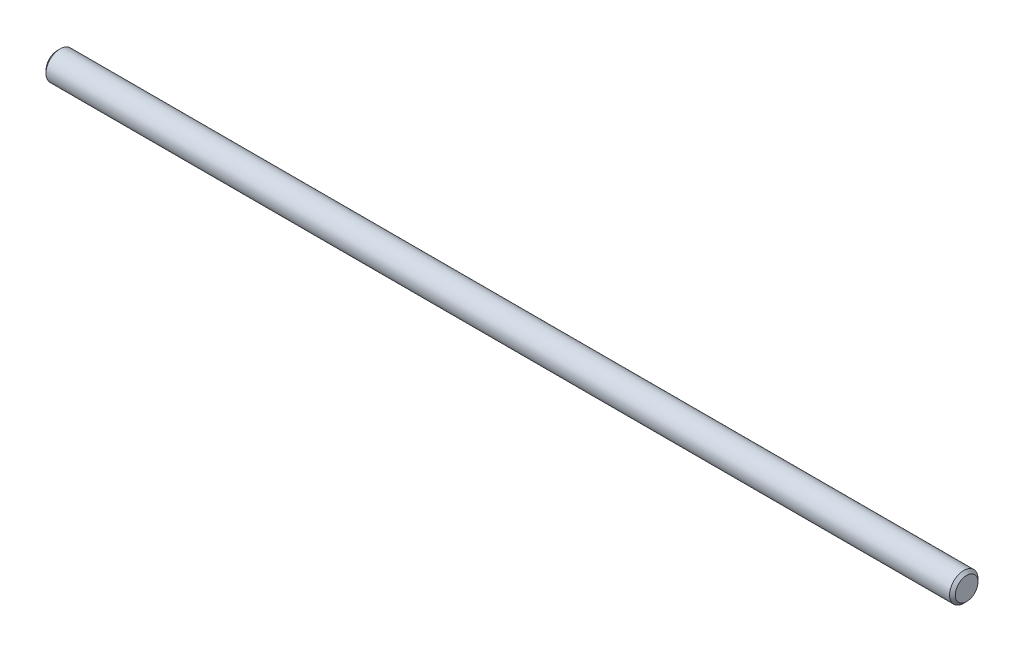
ISO-10303-21;
HEADER;
FILE_DESCRIPTION(('STEP AP214'),'2;1');
FILE_NAME('part.step','',(''),(''),'','','');
FILE_SCHEMA(('AUTOMOTIVE_DESIGN { 1 0 10303 214 1 1 1 1 }'));
ENDSEC;
DATA;
#1=APPLICATION_CONTEXT('core data for automotive mechanical design processes');
#2=APPLICATION_PROTOCOL_DEFINITION('international standard','automotive_design',2000,#1);
#3=PRODUCT_CONTEXT('',#1,'mechanical');
#4=PRODUCT('Part','Part','',(#3));
#5=PRODUCT_RELATED_PRODUCT_CATEGORY('part','',(#4));
#6=PRODUCT_DEFINITION_FORMATION('','',#4);
#7=PRODUCT_DEFINITION_CONTEXT('part definition',#1,'design');
#8=PRODUCT_DEFINITION('design','',#6,#7);
#9=PRODUCT_DEFINITION_SHAPE('','',#8);
#10=(LENGTH_UNIT() NAMED_UNIT(*) SI_UNIT(.MILLI.,.METRE.));
#11=(NAMED_UNIT(*) PLANE_ANGLE_UNIT() SI_UNIT($,.RADIAN.));
#12=(NAMED_UNIT(*) SI_UNIT($,.STERADIAN.) SOLID_ANGLE_UNIT());
#13=UNCERTAINTY_MEASURE_WITH_UNIT(LENGTH_MEASURE(1.E-05),#10,'distance_accuracy_value','');
#14=(GEOMETRIC_REPRESENTATION_CONTEXT(3) GLOBAL_UNCERTAINTY_ASSIGNED_CONTEXT((#13)) GLOBAL_UNIT_ASSIGNED_CONTEXT((#10,
#11,#12)) REPRESENTATION_CONTEXT('',''));
#15=CARTESIAN_POINT('',(0.,0.,0.));
#16=DIRECTION('',(0.,0.,1.));
#17=DIRECTION('',(1.,0.,0.));
#18=AXIS2_PLACEMENT_3D('',#15,#16,#17);
#19=CARTESIAN_POINT('',(-101.6,0.,0.));
#20=DIRECTION('',(1.,0.,0.));
#21=DIRECTION('',(0.,0.,-1.));
#22=AXIS2_PLACEMENT_3D('',#19,#20,#21);
#23=CYLINDRICAL_SURFACE('',#22,3.175);
#24=CARTESIAN_POINT('',(100.965,0.,0.));
#25=DIRECTION('',(1.,0.,0.));
#26=DIRECTION('',(0.,0.,-1.));
#27=AXIS2_PLACEMENT_3D('',#24,#25,#26);
#28=CIRCLE('',#27,3.175);
#29=CARTESIAN_POINT('',(100.965,0.,-3.175));
#30=VERTEX_POINT('',#29);
#31=EDGE_CURVE('E37',#30,#30,#28,.F.);
#32=ORIENTED_EDGE('',*,*,#31,.T.);
#33=EDGE_LOOP('',(#32));
#34=FACE_BOUND('',#33,.T.);
#35=CARTESIAN_POINT('',(-100.965,0.,0.));
#36=DIRECTION('',(1.,0.,0.));
#37=DIRECTION('',(0.,0.,-1.));
#38=AXIS2_PLACEMENT_3D('',#35,#36,#37);
#39=CIRCLE('',#38,3.175);
#40=CARTESIAN_POINT('',(-100.965,0.,-3.175));
#41=VERTEX_POINT('',#40);
#42=EDGE_CURVE('E41',#41,#41,#39,.T.);
#43=ORIENTED_EDGE('',*,*,#42,.T.);
#44=EDGE_LOOP('',(#43));
#45=FACE_BOUND('',#44,.T.);
#46=ADVANCED_FACE('F30',(#34,#45),#23,.T.);
#47=CARTESIAN_POINT('',(-101.6,0.,0.));
#48=DIRECTION('',(1.,0.,0.));
#49=DIRECTION('',(0.,0.,-1.));
#50=AXIS2_PLACEMENT_3D('',#47,#48,#49);
#51=PLANE('',#50);
#52=CARTESIAN_POINT('',(-101.6,0.,0.));
#53=DIRECTION('',(1.,0.,0.));
#54=DIRECTION('',(0.,0.,-1.));
#55=AXIS2_PLACEMENT_3D('',#52,#53,#54);
#56=CIRCLE('',#55,2.54000000000001);
#57=CARTESIAN_POINT('',(-101.6,0.,-2.54000000000001));
#58=VERTEX_POINT('',#57);
#59=EDGE_CURVE('E10',#58,#58,#56,.F.);
#60=ORIENTED_EDGE('',*,*,#59,.T.);
#61=EDGE_LOOP('',(#60));
#62=FACE_BOUND('',#61,.T.);
#63=ADVANCED_FACE('F61',(#62),#51,.F.);
#64=CARTESIAN_POINT('',(101.6,0.,0.));
#65=DIRECTION('',(1.,0.,0.));
#66=DIRECTION('',(0.,0.,-1.));
#67=AXIS2_PLACEMENT_3D('',#64,#65,#66);
#68=PLANE('',#67);
#69=CARTESIAN_POINT('',(101.6,0.,0.));
#70=DIRECTION('',(1.,0.,0.));
#71=DIRECTION('',(0.,0.,-1.));
#72=AXIS2_PLACEMENT_3D('',#69,#70,#71);
#73=CIRCLE('',#72,2.54000000000001);
#74=CARTESIAN_POINT('',(101.6,0.,-2.54000000000001));
#75=VERTEX_POINT('',#74);
#76=EDGE_CURVE('E45',#75,#75,#73,.T.);
#77=ORIENTED_EDGE('',*,*,#76,.T.);
#78=EDGE_LOOP('',(#77));
#79=FACE_BOUND('',#78,.T.);
#80=ADVANCED_FACE('F51',(#79),#68,.T.);
#81=CARTESIAN_POINT('',(101.6,0.,0.));
#82=DIRECTION('',(-1.,0.,0.));
#83=DIRECTION('',(0.,0.,1.));
#84=AXIS2_PLACEMENT_3D('',#81,#82,#83);
#85=CONICAL_SURFACE('',#84,2.54000000000001,0.785398163397462);
#86=ORIENTED_EDGE('',*,*,#31,.F.);
#87=EDGE_LOOP('',(#86));
#88=FACE_BOUND('',#87,.T.);
#89=ORIENTED_EDGE('',*,*,#76,.F.);
#90=EDGE_LOOP('',(#89));
#91=FACE_BOUND('',#90,.T.);
#92=ADVANCED_FACE('F53',(#88,#91),#85,.T.);
#93=CARTESIAN_POINT('',(-100.965,0.,0.));
#94=DIRECTION('',(1.,0.,0.));
#95=DIRECTION('',(0.,0.,-1.));
#96=AXIS2_PLACEMENT_3D('',#93,#94,#95);
#97=CONICAL_SURFACE('',#96,3.175,0.785398163397462);
#98=ORIENTED_EDGE('',*,*,#59,.F.);
#99=EDGE_LOOP('',(#98));
#100=FACE_BOUND('',#99,.T.);
#101=ORIENTED_EDGE('',*,*,#42,.F.);
#102=EDGE_LOOP('',(#101));
#103=FACE_BOUND('',#102,.T.);
#104=ADVANCED_FACE('F32',(#100,#103),#97,.T.);
#105=CLOSED_SHELL('',(#46,#63,#80,#92,#104));
#106=MANIFOLD_SOLID_BREP('B2',#105);
#107=ADVANCED_BREP_SHAPE_REPRESENTATION('',(#18,#106),#14);
#108=SHAPE_DEFINITION_REPRESENTATION(#9,#107);
ENDSEC;
END-ISO-10303-21;
